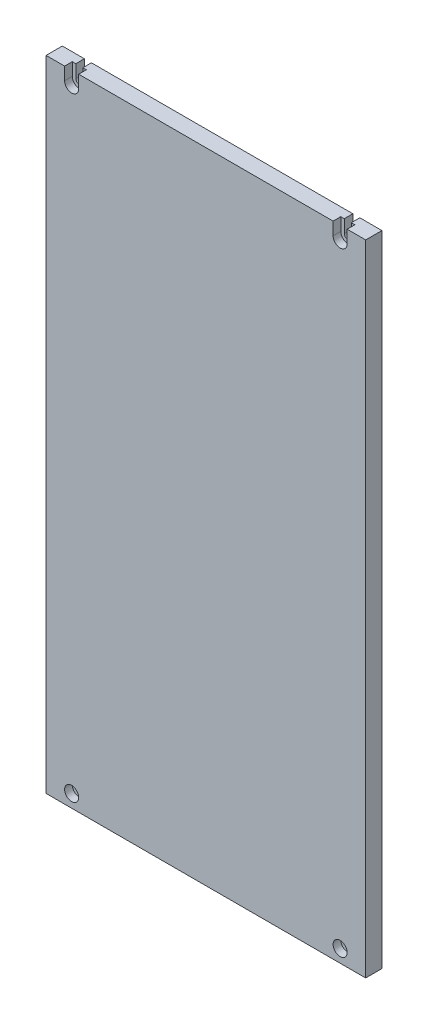
ISO-10303-21;
HEADER;
FILE_DESCRIPTION(('STEP AP214'),'2;1');
FILE_NAME('part.step','',(''),(''),'','','');
FILE_SCHEMA(('AUTOMOTIVE_DESIGN { 1 0 10303 214 1 1 1 1 }'));
ENDSEC;
DATA;
#1=APPLICATION_CONTEXT('core data for automotive mechanical design processes');
#2=APPLICATION_PROTOCOL_DEFINITION('international standard','automotive_design',2000,#1);
#3=PRODUCT_CONTEXT('',#1,'mechanical');
#4=PRODUCT('Part','Part','',(#3));
#5=PRODUCT_RELATED_PRODUCT_CATEGORY('part','',(#4));
#6=PRODUCT_DEFINITION_FORMATION('','',#4);
#7=PRODUCT_DEFINITION_CONTEXT('part definition',#1,'design');
#8=PRODUCT_DEFINITION('design','',#6,#7);
#9=PRODUCT_DEFINITION_SHAPE('','',#8);
#10=(LENGTH_UNIT() NAMED_UNIT(*) SI_UNIT(.MILLI.,.METRE.));
#11=(NAMED_UNIT(*) PLANE_ANGLE_UNIT() SI_UNIT($,.RADIAN.));
#12=(NAMED_UNIT(*) SI_UNIT($,.STERADIAN.) SOLID_ANGLE_UNIT());
#13=UNCERTAINTY_MEASURE_WITH_UNIT(LENGTH_MEASURE(1.E-05),#10,'distance_accuracy_value','');
#14=(GEOMETRIC_REPRESENTATION_CONTEXT(3) GLOBAL_UNCERTAINTY_ASSIGNED_CONTEXT((#13)) GLOBAL_UNIT_ASSIGNED_CONTEXT((#10,
#11,#12)) REPRESENTATION_CONTEXT('',''));
#15=CARTESIAN_POINT('',(0.,0.,0.));
#16=DIRECTION('',(0.,0.,1.));
#17=DIRECTION('',(1.,0.,0.));
#18=AXIS2_PLACEMENT_3D('',#15,#16,#17);
#19=CARTESIAN_POINT('',(105.,240.,9.7));
#20=DIRECTION('',(0.,0.,1.));
#21=DIRECTION('',(1.,0.,0.));
#22=AXIS2_PLACEMENT_3D('',#19,#20,#21);
#23=CYLINDRICAL_SURFACE('',#22,5.5);
#24=CARTESIAN_POINT('',(105.,240.,6.7));
#25=DIRECTION('',(0.,0.,1.));
#26=DIRECTION('',(1.,0.,0.));
#27=AXIS2_PLACEMENT_3D('',#24,#25,#26);
#28=CIRCLE('',#27,5.5);
#29=CARTESIAN_POINT('',(99.5,240.,6.7));
#30=VERTEX_POINT('',#29);
#31=CARTESIAN_POINT('',(110.5,240.,6.7));
#32=VERTEX_POINT('',#31);
#33=EDGE_CURVE('E232',#30,#32,#28,.T.);
#34=ORIENTED_EDGE('',*,*,#33,.F.);
#35=DIRECTION('',(0.,0.,1.));
#36=VECTOR('',#35,1.);
#37=CARTESIAN_POINT('',(99.5,240.,12.7));
#38=LINE('',#37,#36);
#39=CARTESIAN_POINT('',(99.5,240.,12.7));
#40=VERTEX_POINT('',#39);
#41=EDGE_CURVE('E195',#30,#40,#38,.T.);
#42=ORIENTED_EDGE('',*,*,#41,.T.);
#43=CARTESIAN_POINT('',(105.,240.,12.7));
#44=DIRECTION('',(0.,0.,1.));
#45=DIRECTION('',(1.,0.,0.));
#46=AXIS2_PLACEMENT_3D('',#43,#44,#45);
#47=CIRCLE('',#46,5.5);
#48=CARTESIAN_POINT('',(110.5,240.,12.7));
#49=VERTEX_POINT('',#48);
#50=EDGE_CURVE('E124',#49,#40,#47,.F.);
#51=ORIENTED_EDGE('',*,*,#50,.F.);
#52=DIRECTION('',(0.,0.,1.));
#53=VECTOR('',#52,1.);
#54=CARTESIAN_POINT('',(110.5,240.,12.7));
#55=LINE('',#54,#53);
#56=EDGE_CURVE('E115',#49,#32,#55,.F.);
#57=ORIENTED_EDGE('',*,*,#56,.T.);
#58=EDGE_LOOP('',(#34,#42,#51,#57));
#59=FACE_BOUND('',#58,.T.);
#60=ADVANCED_FACE('F16',(#59),#23,.F.);
#61=CARTESIAN_POINT('',(-105.,240.,9.7));
#62=DIRECTION('',(0.,0.,1.));
#63=DIRECTION('',(1.,0.,0.));
#64=AXIS2_PLACEMENT_3D('',#61,#62,#63);
#65=CYLINDRICAL_SURFACE('',#64,5.5);
#66=CARTESIAN_POINT('',(-105.,240.,6.7));
#67=DIRECTION('',(0.,0.,1.));
#68=DIRECTION('',(1.,0.,0.));
#69=AXIS2_PLACEMENT_3D('',#66,#67,#68);
#70=CIRCLE('',#69,5.5);
#71=CARTESIAN_POINT('',(-110.5,240.,6.7));
#72=VERTEX_POINT('',#71);
#73=CARTESIAN_POINT('',(-99.5,240.,6.7));
#74=VERTEX_POINT('',#73);
#75=EDGE_CURVE('E111',#72,#74,#70,.T.);
#76=ORIENTED_EDGE('',*,*,#75,.F.);
#77=DIRECTION('',(0.,0.,1.));
#78=VECTOR('',#77,1.);
#79=CARTESIAN_POINT('',(-110.5,240.,12.7));
#80=LINE('',#79,#78);
#81=CARTESIAN_POINT('',(-110.5,240.,12.7));
#82=VERTEX_POINT('',#81);
#83=EDGE_CURVE('E109',#72,#82,#80,.T.);
#84=ORIENTED_EDGE('',*,*,#83,.T.);
#85=CARTESIAN_POINT('',(-105.,240.,12.7));
#86=DIRECTION('',(0.,0.,1.));
#87=DIRECTION('',(1.,0.,0.));
#88=AXIS2_PLACEMENT_3D('',#85,#86,#87);
#89=CIRCLE('',#88,5.5);
#90=CARTESIAN_POINT('',(-99.5,240.,12.7));
#91=VERTEX_POINT('',#90);
#92=EDGE_CURVE('E95',#91,#82,#89,.F.);
#93=ORIENTED_EDGE('',*,*,#92,.F.);
#94=DIRECTION('',(0.,0.,1.));
#95=VECTOR('',#94,1.);
#96=CARTESIAN_POINT('',(-99.5,240.,12.7));
#97=LINE('',#96,#95);
#98=EDGE_CURVE('E89',#91,#74,#97,.F.);
#99=ORIENTED_EDGE('',*,*,#98,.T.);
#100=EDGE_LOOP('',(#76,#84,#93,#99));
#101=FACE_BOUND('',#100,.T.);
#102=ADVANCED_FACE('F110',(#101),#65,.F.);
#103=CARTESIAN_POINT('',(-105.,-240.,9.7));
#104=DIRECTION('',(0.,0.,1.));
#105=DIRECTION('',(1.,0.,0.));
#106=AXIS2_PLACEMENT_3D('',#103,#104,#105);
#107=CYLINDRICAL_SURFACE('',#106,5.5);
#108=CARTESIAN_POINT('',(-105.,-240.,6.7));
#109=DIRECTION('',(0.,0.,1.));
#110=DIRECTION('',(1.,0.,0.));
#111=AXIS2_PLACEMENT_3D('',#108,#109,#110);
#112=CIRCLE('',#111,5.5);
#113=CARTESIAN_POINT('',(-99.5,-240.,6.7));
#114=VERTEX_POINT('',#113);
#115=EDGE_CURVE('E226',#114,#114,#112,.T.);
#116=ORIENTED_EDGE('',*,*,#115,.F.);
#117=EDGE_LOOP('',(#116));
#118=FACE_BOUND('',#117,.T.);
#119=CARTESIAN_POINT('',(-105.,-240.,12.7));
#120=DIRECTION('',(0.,0.,1.));
#121=DIRECTION('',(1.,0.,0.));
#122=AXIS2_PLACEMENT_3D('',#119,#120,#121);
#123=CIRCLE('',#122,5.5);
#124=CARTESIAN_POINT('',(-99.5,-240.,12.7));
#125=VERTEX_POINT('',#124);
#126=EDGE_CURVE('E132',#125,#125,#123,.F.);
#127=ORIENTED_EDGE('',*,*,#126,.F.);
#128=EDGE_LOOP('',(#127));
#129=FACE_BOUND('',#128,.T.);
#130=ADVANCED_FACE('F244',(#118,#129),#107,.F.);
#131=CARTESIAN_POINT('',(105.,-240.,9.7));
#132=DIRECTION('',(0.,0.,1.));
#133=DIRECTION('',(1.,0.,0.));
#134=AXIS2_PLACEMENT_3D('',#131,#132,#133);
#135=CYLINDRICAL_SURFACE('',#134,5.5);
#136=CARTESIAN_POINT('',(105.,-240.,6.7));
#137=DIRECTION('',(0.,0.,1.));
#138=DIRECTION('',(1.,0.,0.));
#139=AXIS2_PLACEMENT_3D('',#136,#137,#138);
#140=CIRCLE('',#139,5.5);
#141=CARTESIAN_POINT('',(110.5,-240.,6.7));
#142=VERTEX_POINT('',#141);
#143=EDGE_CURVE('E186',#142,#142,#140,.T.);
#144=ORIENTED_EDGE('',*,*,#143,.F.);
#145=EDGE_LOOP('',(#144));
#146=FACE_BOUND('',#145,.T.);
#147=CARTESIAN_POINT('',(105.,-240.,12.7));
#148=DIRECTION('',(0.,0.,1.));
#149=DIRECTION('',(1.,0.,0.));
#150=AXIS2_PLACEMENT_3D('',#147,#148,#149);
#151=CIRCLE('',#150,5.5);
#152=CARTESIAN_POINT('',(110.5,-240.,12.7));
#153=VERTEX_POINT('',#152);
#154=EDGE_CURVE('E19',#153,#153,#151,.F.);
#155=ORIENTED_EDGE('',*,*,#154,.F.);
#156=EDGE_LOOP('',(#155));
#157=FACE_BOUND('',#156,.T.);
#158=ADVANCED_FACE('F242',(#146,#157),#135,.F.);
#159=CARTESIAN_POINT('',(-110.5,240.,12.7));
#160=DIRECTION('',(-1.,0.,0.));
#161=DIRECTION('',(0.,0.,1.));
#162=AXIS2_PLACEMENT_3D('',#159,#160,#161);
#163=PLANE('',#162);
#164=ORIENTED_EDGE('',*,*,#83,.F.);
#165=DIRECTION('',(0.,1.,0.));
#166=VECTOR('',#165,1.);
#167=CARTESIAN_POINT('',(-110.5,240.,6.7));
#168=LINE('',#167,#166);
#169=CARTESIAN_POINT('',(-110.5,250.,6.7));
#170=VERTEX_POINT('',#169);
#171=EDGE_CURVE('E231',#170,#72,#168,.F.);
#172=ORIENTED_EDGE('',*,*,#171,.F.);
#173=DIRECTION('',(0.,0.,1.));
#174=VECTOR('',#173,1.);
#175=CARTESIAN_POINT('',(-110.5,250.,0.));
#176=LINE('',#175,#174);
#177=CARTESIAN_POINT('',(-110.5,250.,12.7));
#178=VERTEX_POINT('',#177);
#179=EDGE_CURVE('E120',#178,#170,#176,.F.);
#180=ORIENTED_EDGE('',*,*,#179,.F.);
#181=DIRECTION('',(0.,1.,0.));
#182=VECTOR('',#181,1.);
#183=CARTESIAN_POINT('',(-110.5,0.,12.7));
#184=LINE('',#183,#182);
#185=EDGE_CURVE('E102',#82,#178,#184,.T.);
#186=ORIENTED_EDGE('',*,*,#185,.F.);
#187=EDGE_LOOP('',(#164,#172,#180,#186));
#188=FACE_BOUND('',#187,.T.);
#189=ADVANCED_FACE('F118',(#188),#163,.F.);
#190=CARTESIAN_POINT('',(110.5,250.,12.7));
#191=DIRECTION('',(1.,0.,0.));
#192=DIRECTION('',(0.,1.,0.));
#193=AXIS2_PLACEMENT_3D('',#190,#191,#192);
#194=PLANE('',#193);
#195=DIRECTION('',(0.,0.,1.));
#196=VECTOR('',#195,1.);
#197=CARTESIAN_POINT('',(110.5,250.,0.));
#198=LINE('',#197,#196);
#199=CARTESIAN_POINT('',(110.5,250.,6.7));
#200=VERTEX_POINT('',#199);
#201=CARTESIAN_POINT('',(110.5,250.,12.7));
#202=VERTEX_POINT('',#201);
#203=EDGE_CURVE('E152',#200,#202,#198,.T.);
#204=ORIENTED_EDGE('',*,*,#203,.F.);
#205=DIRECTION('',(0.,1.,0.));
#206=VECTOR('',#205,1.);
#207=CARTESIAN_POINT('',(110.5,240.,6.7));
#208=LINE('',#207,#206);
#209=EDGE_CURVE('E234',#32,#200,#208,.T.);
#210=ORIENTED_EDGE('',*,*,#209,.F.);
#211=ORIENTED_EDGE('',*,*,#56,.F.);
#212=DIRECTION('',(0.,1.,0.));
#213=VECTOR('',#212,1.);
#214=CARTESIAN_POINT('',(110.5,0.,12.7));
#215=LINE('',#214,#213);
#216=EDGE_CURVE('E121',#202,#49,#215,.F.);
#217=ORIENTED_EDGE('',*,*,#216,.F.);
#218=EDGE_LOOP('',(#204,#210,#211,#217));
#219=FACE_BOUND('',#218,.T.);
#220=ADVANCED_FACE('F252',(#219),#194,.F.);
#221=CARTESIAN_POINT('',(-99.5,250.,12.7));
#222=DIRECTION('',(1.,0.,0.));
#223=DIRECTION('',(0.,1.,0.));
#224=AXIS2_PLACEMENT_3D('',#221,#222,#223);
#225=PLANE('',#224);
#226=DIRECTION('',(0.,0.,1.));
#227=VECTOR('',#226,1.);
#228=CARTESIAN_POINT('',(-99.5,250.,0.));
#229=LINE('',#228,#227);
#230=CARTESIAN_POINT('',(-99.5,250.,6.7));
#231=VERTEX_POINT('',#230);
#232=CARTESIAN_POINT('',(-99.5,250.,12.7));
#233=VERTEX_POINT('',#232);
#234=EDGE_CURVE('E135',#231,#233,#229,.T.);
#235=ORIENTED_EDGE('',*,*,#234,.F.);
#236=DIRECTION('',(0.,1.,0.));
#237=VECTOR('',#236,1.);
#238=CARTESIAN_POINT('',(-99.5,240.,6.7));
#239=LINE('',#238,#237);
#240=EDGE_CURVE('E229',#74,#231,#239,.T.);
#241=ORIENTED_EDGE('',*,*,#240,.F.);
#242=ORIENTED_EDGE('',*,*,#98,.F.);
#243=DIRECTION('',(0.,1.,0.));
#244=VECTOR('',#243,1.);
#245=CARTESIAN_POINT('',(-99.5,0.,12.7));
#246=LINE('',#245,#244);
#247=EDGE_CURVE('E105',#233,#91,#246,.F.);
#248=ORIENTED_EDGE('',*,*,#247,.F.);
#249=EDGE_LOOP('',(#235,#241,#242,#248));
#250=FACE_BOUND('',#249,.T.);
#251=ADVANCED_FACE('F343',(#250),#225,.F.);
#252=CARTESIAN_POINT('',(0.,0.,12.7));
#253=DIRECTION('',(0.,0.,1.));
#254=DIRECTION('',(1.,0.,0.));
#255=AXIS2_PLACEMENT_3D('',#252,#253,#254);
#256=PLANE('',#255);
#257=DIRECTION('',(0.,-1.,0.));
#258=VECTOR('',#257,1.);
#259=CARTESIAN_POINT('',(99.5,240.,12.7));
#260=LINE('',#259,#258);
#261=CARTESIAN_POINT('',(99.5,250.,12.7));
#262=VERTEX_POINT('',#261);
#263=EDGE_CURVE('E197',#40,#262,#260,.F.);
#264=ORIENTED_EDGE('',*,*,#263,.T.);
#265=DIRECTION('',(1.,0.,0.));
#266=VECTOR('',#265,1.);
#267=CARTESIAN_POINT('',(125.,250.,12.7));
#268=LINE('',#267,#266);
#269=EDGE_CURVE('E138',#233,#262,#268,.T.);
#270=ORIENTED_EDGE('',*,*,#269,.F.);
#271=ORIENTED_EDGE('',*,*,#247,.T.);
#272=ORIENTED_EDGE('',*,*,#92,.T.);
#273=ORIENTED_EDGE('',*,*,#185,.T.);
#274=DIRECTION('',(1.,0.,0.));
#275=VECTOR('',#274,1.);
#276=CARTESIAN_POINT('',(125.,250.,12.7));
#277=LINE('',#276,#275);
#278=CARTESIAN_POINT('',(-125.,250.,12.7));
#279=VERTEX_POINT('',#278);
#280=EDGE_CURVE('E184',#279,#178,#277,.T.);
#281=ORIENTED_EDGE('',*,*,#280,.F.);
#282=DIRECTION('',(0.,-1.,0.));
#283=VECTOR('',#282,1.);
#284=CARTESIAN_POINT('',(-125.,250.,12.7));
#285=LINE('',#284,#283);
#286=CARTESIAN_POINT('',(-125.,-250.,12.7));
#287=VERTEX_POINT('',#286);
#288=EDGE_CURVE('E178',#287,#279,#285,.F.);
#289=ORIENTED_EDGE('',*,*,#288,.F.);
#290=DIRECTION('',(1.,0.,0.));
#291=VECTOR('',#290,1.);
#292=CARTESIAN_POINT('',(-125.,-250.,12.7));
#293=LINE('',#292,#291);
#294=CARTESIAN_POINT('',(125.,-250.,12.7));
#295=VERTEX_POINT('',#294);
#296=EDGE_CURVE('E172',#295,#287,#293,.F.);
#297=ORIENTED_EDGE('',*,*,#296,.F.);
#298=DIRECTION('',(0.,1.,0.));
#299=VECTOR('',#298,1.);
#300=CARTESIAN_POINT('',(125.,-250.,12.7));
#301=LINE('',#300,#299);
#302=CARTESIAN_POINT('',(125.,250.,12.7));
#303=VERTEX_POINT('',#302);
#304=EDGE_CURVE('E156',#303,#295,#301,.F.);
#305=ORIENTED_EDGE('',*,*,#304,.F.);
#306=DIRECTION('',(1.,0.,0.));
#307=VECTOR('',#306,1.);
#308=CARTESIAN_POINT('',(125.,250.,12.7));
#309=LINE('',#308,#307);
#310=EDGE_CURVE('E162',#202,#303,#309,.T.);
#311=ORIENTED_EDGE('',*,*,#310,.F.);
#312=ORIENTED_EDGE('',*,*,#216,.T.);
#313=ORIENTED_EDGE('',*,*,#50,.T.);
#314=EDGE_LOOP('',(#264,#270,#271,#272,#273,#281,#289,#297,#305,#311,#312,#313));
#315=FACE_BOUND('',#314,.T.);
#316=ORIENTED_EDGE('',*,*,#126,.T.);
#317=EDGE_LOOP('',(#316));
#318=FACE_BOUND('',#317,.T.);
#319=ORIENTED_EDGE('',*,*,#154,.T.);
#320=EDGE_LOOP('',(#319));
#321=FACE_BOUND('',#320,.T.);
#322=ADVANCED_FACE('F98',(#315,#318,#321),#256,.T.);
#323=CARTESIAN_POINT('',(99.5,240.,12.7));
#324=DIRECTION('',(-1.,0.,0.));
#325=DIRECTION('',(0.,-1.,0.));
#326=AXIS2_PLACEMENT_3D('',#323,#324,#325);
#327=PLANE('',#326);
#328=ORIENTED_EDGE('',*,*,#41,.F.);
#329=DIRECTION('',(0.,1.,0.));
#330=VECTOR('',#329,1.);
#331=CARTESIAN_POINT('',(99.5,240.,6.7));
#332=LINE('',#331,#330);
#333=CARTESIAN_POINT('',(99.5,250.,6.7));
#334=VERTEX_POINT('',#333);
#335=EDGE_CURVE('E235',#334,#30,#332,.F.);
#336=ORIENTED_EDGE('',*,*,#335,.F.);
#337=DIRECTION('',(0.,0.,1.));
#338=VECTOR('',#337,1.);
#339=CARTESIAN_POINT('',(99.5,250.,0.));
#340=LINE('',#339,#338);
#341=EDGE_CURVE('E387',#262,#334,#340,.F.);
#342=ORIENTED_EDGE('',*,*,#341,.F.);
#343=ORIENTED_EDGE('',*,*,#263,.F.);
#344=EDGE_LOOP('',(#328,#336,#342,#343));
#345=FACE_BOUND('',#344,.T.);
#346=ADVANCED_FACE('F336',(#345),#327,.F.);
#347=CARTESIAN_POINT('',(105.,240.,6.7));
#348=DIRECTION('',(0.,0.,1.));
#349=DIRECTION('',(1.,0.,0.));
#350=AXIS2_PLACEMENT_3D('',#347,#348,#349);
#351=PLANE('',#350);
#352=ORIENTED_EDGE('',*,*,#209,.T.);
#353=DIRECTION('',(1.,0.,0.));
#354=VECTOR('',#353,1.);
#355=CARTESIAN_POINT('',(125.,250.,6.7));
#356=LINE('',#355,#354);
#357=CARTESIAN_POINT('',(107.75,250.,6.7));
#358=VERTEX_POINT('',#357);
#359=EDGE_CURVE('E149',#358,#200,#356,.T.);
#360=ORIENTED_EDGE('',*,*,#359,.F.);
#361=DIRECTION('',(0.,1.,0.));
#362=VECTOR('',#361,1.);
#363=CARTESIAN_POINT('',(107.75,250.,6.7));
#364=LINE('',#363,#362);
#365=CARTESIAN_POINT('',(107.75,240.,6.70000000000003));
#366=VERTEX_POINT('',#365);
#367=EDGE_CURVE('E142',#358,#366,#364,.F.);
#368=ORIENTED_EDGE('',*,*,#367,.T.);
#369=CARTESIAN_POINT('',(105.,240.,6.70000000000004));
#370=DIRECTION('',(0.,0.,1.));
#371=DIRECTION('',(1.,0.,0.));
#372=AXIS2_PLACEMENT_3D('',#369,#370,#371);
#373=CIRCLE('',#372,2.75);
#374=CARTESIAN_POINT('',(102.25,240.,6.70000000000002));
#375=VERTEX_POINT('',#374);
#376=EDGE_CURVE('E145',#366,#375,#373,.F.);
#377=ORIENTED_EDGE('',*,*,#376,.T.);
#378=DIRECTION('',(0.,1.,0.));
#379=VECTOR('',#378,1.);
#380=CARTESIAN_POINT('',(102.25,240.,6.69999999999999));
#381=LINE('',#380,#379);
#382=CARTESIAN_POINT('',(102.25,250.,6.7));
#383=VERTEX_POINT('',#382);
#384=EDGE_CURVE('E475',#375,#383,#381,.T.);
#385=ORIENTED_EDGE('',*,*,#384,.T.);
#386=DIRECTION('',(1.,0.,0.));
#387=VECTOR('',#386,1.);
#388=CARTESIAN_POINT('',(125.,250.,6.7));
#389=LINE('',#388,#387);
#390=EDGE_CURVE('E392',#334,#383,#389,.T.);
#391=ORIENTED_EDGE('',*,*,#390,.F.);
#392=ORIENTED_EDGE('',*,*,#335,.T.);
#393=ORIENTED_EDGE('',*,*,#33,.T.);
#394=EDGE_LOOP('',(#352,#360,#368,#377,#385,#391,#392,#393));
#395=FACE_BOUND('',#394,.T.);
#396=ADVANCED_FACE('F332',(#395),#351,.T.);
#397=CARTESIAN_POINT('',(-105.,240.,6.7));
#398=DIRECTION('',(0.,0.,1.));
#399=DIRECTION('',(1.,0.,0.));
#400=AXIS2_PLACEMENT_3D('',#397,#398,#399);
#401=PLANE('',#400);
#402=DIRECTION('',(0.,1.,0.));
#403=VECTOR('',#402,1.);
#404=CARTESIAN_POINT('',(-102.25,250.,6.7));
#405=LINE('',#404,#403);
#406=CARTESIAN_POINT('',(-102.25,250.,6.7));
#407=VERTEX_POINT('',#406);
#408=CARTESIAN_POINT('',(-102.25,240.,6.70000000000003));
#409=VERTEX_POINT('',#408);
#410=EDGE_CURVE('E466',#407,#409,#405,.F.);
#411=ORIENTED_EDGE('',*,*,#410,.T.);
#412=CARTESIAN_POINT('',(-105.,240.,6.70000000000004));
#413=DIRECTION('',(0.,0.,1.));
#414=DIRECTION('',(1.,0.,0.));
#415=AXIS2_PLACEMENT_3D('',#412,#413,#414);
#416=CIRCLE('',#415,2.75);
#417=CARTESIAN_POINT('',(-107.75,240.,6.70000000000002));
#418=VERTEX_POINT('',#417);
#419=EDGE_CURVE('E219',#409,#418,#416,.F.);
#420=ORIENTED_EDGE('',*,*,#419,.T.);
#421=DIRECTION('',(0.,-1.,0.));
#422=VECTOR('',#421,1.);
#423=CARTESIAN_POINT('',(-107.75,240.,6.69999999999999));
#424=LINE('',#423,#422);
#425=CARTESIAN_POINT('',(-107.75,250.,6.69999999999999));
#426=VERTEX_POINT('',#425);
#427=EDGE_CURVE('E456',#418,#426,#424,.F.);
#428=ORIENTED_EDGE('',*,*,#427,.T.);
#429=DIRECTION('',(1.,0.,0.));
#430=VECTOR('',#429,1.);
#431=CARTESIAN_POINT('',(125.,250.,6.7));
#432=LINE('',#431,#430);
#433=EDGE_CURVE('E181',#170,#426,#432,.T.);
#434=ORIENTED_EDGE('',*,*,#433,.F.);
#435=ORIENTED_EDGE('',*,*,#171,.T.);
#436=ORIENTED_EDGE('',*,*,#75,.T.);
#437=ORIENTED_EDGE('',*,*,#240,.T.);
#438=DIRECTION('',(1.,0.,0.));
#439=VECTOR('',#438,1.);
#440=CARTESIAN_POINT('',(125.,250.,6.7));
#441=LINE('',#440,#439);
#442=EDGE_CURVE('E139',#407,#231,#441,.T.);
#443=ORIENTED_EDGE('',*,*,#442,.F.);
#444=EDGE_LOOP('',(#411,#420,#428,#434,#435,#436,#437,#443));
#445=FACE_BOUND('',#444,.T.);
#446=ADVANCED_FACE('F328',(#445),#401,.T.);
#447=CARTESIAN_POINT('',(-105.,-240.,6.7));
#448=DIRECTION('',(0.,0.,1.));
#449=DIRECTION('',(1.,0.,0.));
#450=AXIS2_PLACEMENT_3D('',#447,#448,#449);
#451=PLANE('',#450);
#452=CARTESIAN_POINT('',(-105.,-240.,6.70000000000004));
#453=DIRECTION('',(0.,0.,1.));
#454=DIRECTION('',(1.,0.,0.));
#455=AXIS2_PLACEMENT_3D('',#452,#453,#454);
#456=CIRCLE('',#455,2.75);
#457=CARTESIAN_POINT('',(-102.25,-240.,6.70000000000004));
#458=VERTEX_POINT('',#457);
#459=EDGE_CURVE('E215',#458,#458,#456,.F.);
#460=ORIENTED_EDGE('',*,*,#459,.T.);
#461=EDGE_LOOP('',(#460));
#462=FACE_BOUND('',#461,.T.);
#463=ORIENTED_EDGE('',*,*,#115,.T.);
#464=EDGE_LOOP('',(#463));
#465=FACE_BOUND('',#464,.T.);
#466=ADVANCED_FACE('F324',(#462,#465),#451,.T.);
#467=CARTESIAN_POINT('',(105.,-240.,6.7));
#468=DIRECTION('',(0.,0.,1.));
#469=DIRECTION('',(1.,0.,0.));
#470=AXIS2_PLACEMENT_3D('',#467,#468,#469);
#471=PLANE('',#470);
#472=CARTESIAN_POINT('',(105.,-240.,6.70000000000004));
#473=DIRECTION('',(0.,0.,1.));
#474=DIRECTION('',(1.,0.,0.));
#475=AXIS2_PLACEMENT_3D('',#472,#473,#474);
#476=CIRCLE('',#475,2.75);
#477=CARTESIAN_POINT('',(107.75,-240.,6.70000000000004));
#478=VERTEX_POINT('',#477);
#479=EDGE_CURVE('E211',#478,#478,#476,.F.);
#480=ORIENTED_EDGE('',*,*,#479,.T.);
#481=EDGE_LOOP('',(#480));
#482=FACE_BOUND('',#481,.T.);
#483=ORIENTED_EDGE('',*,*,#143,.T.);
#484=EDGE_LOOP('',(#483));
#485=FACE_BOUND('',#484,.T.);
#486=ADVANCED_FACE('F320',(#482,#485),#471,.T.);
#487=CARTESIAN_POINT('',(125.,250.,0.));
#488=DIRECTION('',(0.,1.,0.));
#489=DIRECTION('',(0.,0.,1.));
#490=AXIS2_PLACEMENT_3D('',#487,#488,#489);
#491=PLANE('',#490);
#492=ORIENTED_EDGE('',*,*,#179,.T.);
#493=ORIENTED_EDGE('',*,*,#433,.T.);
#494=DIRECTION('',(0.,0.,1.));
#495=VECTOR('',#494,1.);
#496=CARTESIAN_POINT('',(-107.75,250.,6.7));
#497=LINE('',#496,#495);
#498=CARTESIAN_POINT('',(-107.75,250.,0.));
#499=VERTEX_POINT('',#498);
#500=EDGE_CURVE('E218',#426,#499,#497,.F.);
#501=ORIENTED_EDGE('',*,*,#500,.T.);
#502=DIRECTION('',(1.,0.,0.));
#503=VECTOR('',#502,1.);
#504=CARTESIAN_POINT('',(0.,250.,0.));
#505=LINE('',#504,#503);
#506=CARTESIAN_POINT('',(-125.,250.,0.));
#507=VERTEX_POINT('',#506);
#508=EDGE_CURVE('E214',#499,#507,#505,.F.);
#509=ORIENTED_EDGE('',*,*,#508,.T.);
#510=DIRECTION('',(0.,0.,1.));
#511=VECTOR('',#510,1.);
#512=CARTESIAN_POINT('',(-125.,250.,0.));
#513=LINE('',#512,#511);
#514=EDGE_CURVE('E175',#279,#507,#513,.F.);
#515=ORIENTED_EDGE('',*,*,#514,.F.);
#516=ORIENTED_EDGE('',*,*,#280,.T.);
#517=EDGE_LOOP('',(#492,#493,#501,#509,#515,#516));
#518=FACE_BOUND('',#517,.T.);
#519=ADVANCED_FACE('F316',(#518),#491,.T.);
#520=CARTESIAN_POINT('',(-125.,250.,0.));
#521=DIRECTION('',(-1.,0.,0.));
#522=DIRECTION('',(0.,-1.,0.));
#523=AXIS2_PLACEMENT_3D('',#520,#521,#522);
#524=PLANE('',#523);
#525=ORIENTED_EDGE('',*,*,#288,.T.);
#526=ORIENTED_EDGE('',*,*,#514,.T.);
#527=DIRECTION('',(0.,1.,0.));
#528=VECTOR('',#527,1.);
#529=CARTESIAN_POINT('',(-125.,0.,0.));
#530=LINE('',#529,#528);
#531=CARTESIAN_POINT('',(-125.,-250.,0.));
#532=VERTEX_POINT('',#531);
#533=EDGE_CURVE('E461',#507,#532,#530,.F.);
#534=ORIENTED_EDGE('',*,*,#533,.T.);
#535=DIRECTION('',(0.,0.,1.));
#536=VECTOR('',#535,1.);
#537=CARTESIAN_POINT('',(-125.,-250.,0.));
#538=LINE('',#537,#536);
#539=EDGE_CURVE('E159',#287,#532,#538,.F.);
#540=ORIENTED_EDGE('',*,*,#539,.F.);
#541=EDGE_LOOP('',(#525,#526,#534,#540));
#542=FACE_BOUND('',#541,.T.);
#543=ADVANCED_FACE('F312',(#542),#524,.T.);
#544=CARTESIAN_POINT('',(-125.,-250.,0.));
#545=DIRECTION('',(0.,-1.,0.));
#546=DIRECTION('',(1.,0.,0.));
#547=AXIS2_PLACEMENT_3D('',#544,#545,#546);
#548=PLANE('',#547);
#549=ORIENTED_EDGE('',*,*,#296,.T.);
#550=ORIENTED_EDGE('',*,*,#539,.T.);
#551=DIRECTION('',(1.,0.,0.));
#552=VECTOR('',#551,1.);
#553=CARTESIAN_POINT('',(0.,-250.,0.));
#554=LINE('',#553,#552);
#555=CARTESIAN_POINT('',(125.,-250.,0.));
#556=VERTEX_POINT('',#555);
#557=EDGE_CURVE('E491',#532,#556,#554,.T.);
#558=ORIENTED_EDGE('',*,*,#557,.T.);
#559=DIRECTION('',(0.,0.,1.));
#560=VECTOR('',#559,1.);
#561=CARTESIAN_POINT('',(125.,-250.,0.));
#562=LINE('',#561,#560);
#563=EDGE_CURVE('E153',#295,#556,#562,.F.);
#564=ORIENTED_EDGE('',*,*,#563,.F.);
#565=EDGE_LOOP('',(#549,#550,#558,#564));
#566=FACE_BOUND('',#565,.T.);
#567=ADVANCED_FACE('F308',(#566),#548,.T.);
#568=CARTESIAN_POINT('',(125.,-250.,0.));
#569=DIRECTION('',(1.,0.,0.));
#570=DIRECTION('',(0.,1.,0.));
#571=AXIS2_PLACEMENT_3D('',#568,#569,#570);
#572=PLANE('',#571);
#573=ORIENTED_EDGE('',*,*,#304,.T.);
#574=ORIENTED_EDGE('',*,*,#563,.T.);
#575=DIRECTION('',(0.,1.,0.));
#576=VECTOR('',#575,1.);
#577=CARTESIAN_POINT('',(125.,0.,0.));
#578=LINE('',#577,#576);
#579=CARTESIAN_POINT('',(125.,250.,0.));
#580=VERTEX_POINT('',#579);
#581=EDGE_CURVE('E483',#556,#580,#578,.T.);
#582=ORIENTED_EDGE('',*,*,#581,.T.);
#583=DIRECTION('',(0.,0.,1.));
#584=VECTOR('',#583,1.);
#585=CARTESIAN_POINT('',(125.,250.,0.));
#586=LINE('',#585,#584);
#587=EDGE_CURVE('E165',#303,#580,#586,.F.);
#588=ORIENTED_EDGE('',*,*,#587,.F.);
#589=EDGE_LOOP('',(#573,#574,#582,#588));
#590=FACE_BOUND('',#589,.T.);
#591=ADVANCED_FACE('F304',(#590),#572,.T.);
#592=CARTESIAN_POINT('',(125.,250.,0.));
#593=DIRECTION('',(0.,1.,0.));
#594=DIRECTION('',(0.,0.,1.));
#595=AXIS2_PLACEMENT_3D('',#592,#593,#594);
#596=PLANE('',#595);
#597=ORIENTED_EDGE('',*,*,#587,.T.);
#598=DIRECTION('',(1.,0.,0.));
#599=VECTOR('',#598,1.);
#600=CARTESIAN_POINT('',(0.,250.,0.));
#601=LINE('',#600,#599);
#602=CARTESIAN_POINT('',(107.75,250.,0.));
#603=VERTEX_POINT('',#602);
#604=EDGE_CURVE('E452',#580,#603,#601,.F.);
#605=ORIENTED_EDGE('',*,*,#604,.T.);
#606=DIRECTION('',(0.,0.,-1.));
#607=VECTOR('',#606,1.);
#608=CARTESIAN_POINT('',(107.75,250.,6.7));
#609=LINE('',#608,#607);
#610=EDGE_CURVE('E146',#603,#358,#609,.F.);
#611=ORIENTED_EDGE('',*,*,#610,.T.);
#612=ORIENTED_EDGE('',*,*,#359,.T.);
#613=ORIENTED_EDGE('',*,*,#203,.T.);
#614=ORIENTED_EDGE('',*,*,#310,.T.);
#615=EDGE_LOOP('',(#597,#605,#611,#612,#613,#614));
#616=FACE_BOUND('',#615,.T.);
#617=ADVANCED_FACE('F300',(#616),#596,.T.);
#618=CARTESIAN_POINT('',(107.75,250.,6.7));
#619=DIRECTION('',(1.,0.,0.));
#620=DIRECTION('',(0.,0.,-1.));
#621=AXIS2_PLACEMENT_3D('',#618,#619,#620);
#622=PLANE('',#621);
#623=DIRECTION('',(0.,0.,1.));
#624=VECTOR('',#623,1.);
#625=CARTESIAN_POINT('',(107.75,240.,-546.461237926951));
#626=LINE('',#625,#624);
#627=CARTESIAN_POINT('',(107.75,240.,0.));
#628=VERTEX_POINT('',#627);
#629=EDGE_CURVE('E223',#628,#366,#626,.T.);
#630=ORIENTED_EDGE('',*,*,#629,.T.);
#631=ORIENTED_EDGE('',*,*,#367,.F.);
#632=ORIENTED_EDGE('',*,*,#610,.F.);
#633=DIRECTION('',(0.,1.,0.));
#634=VECTOR('',#633,1.);
#635=CARTESIAN_POINT('',(107.75,0.,0.));
#636=LINE('',#635,#634);
#637=EDGE_CURVE('E210',#603,#628,#636,.F.);
#638=ORIENTED_EDGE('',*,*,#637,.T.);
#639=EDGE_LOOP('',(#630,#631,#632,#638));
#640=FACE_BOUND('',#639,.T.);
#641=ADVANCED_FACE('F296',(#640),#622,.F.);
#642=CARTESIAN_POINT('',(105.,240.,-546.461237926951));
#643=DIRECTION('',(0.,0.,1.));
#644=DIRECTION('',(1.,0.,0.));
#645=AXIS2_PLACEMENT_3D('',#642,#643,#644);
#646=CYLINDRICAL_SURFACE('',#645,2.75);
#647=CARTESIAN_POINT('',(105.,240.,0.));
#648=DIRECTION('',(0.,0.,1.));
#649=DIRECTION('',(1.,0.,0.));
#650=AXIS2_PLACEMENT_3D('',#647,#648,#649);
#651=CIRCLE('',#650,2.75);
#652=CARTESIAN_POINT('',(102.25,240.,0.));
#653=VERTEX_POINT('',#652);
#654=EDGE_CURVE('E206',#628,#653,#651,.F.);
#655=ORIENTED_EDGE('',*,*,#654,.T.);
#656=DIRECTION('',(0.,0.,1.));
#657=VECTOR('',#656,1.);
#658=CARTESIAN_POINT('',(102.25,240.,6.7));
#659=LINE('',#658,#657);
#660=EDGE_CURVE('E442',#653,#375,#659,.T.);
#661=ORIENTED_EDGE('',*,*,#660,.T.);
#662=ORIENTED_EDGE('',*,*,#376,.F.);
#663=ORIENTED_EDGE('',*,*,#629,.F.);
#664=EDGE_LOOP('',(#655,#661,#662,#663));
#665=FACE_BOUND('',#664,.T.);
#666=ADVANCED_FACE('F292',(#665),#646,.F.);
#667=CARTESIAN_POINT('',(102.25,240.,6.7));
#668=DIRECTION('',(-1.,0.,0.));
#669=DIRECTION('',(0.,0.,1.));
#670=AXIS2_PLACEMENT_3D('',#667,#668,#669);
#671=PLANE('',#670);
#672=DIRECTION('',(0.,0.,1.));
#673=VECTOR('',#672,1.);
#674=CARTESIAN_POINT('',(102.25,250.,0.));
#675=LINE('',#674,#673);
#676=CARTESIAN_POINT('',(102.25,250.,0.));
#677=VERTEX_POINT('',#676);
#678=EDGE_CURVE('E427',#383,#677,#675,.F.);
#679=ORIENTED_EDGE('',*,*,#678,.F.);
#680=ORIENTED_EDGE('',*,*,#384,.F.);
#681=ORIENTED_EDGE('',*,*,#660,.F.);
#682=DIRECTION('',(0.,1.,0.));
#683=VECTOR('',#682,1.);
#684=CARTESIAN_POINT('',(102.25,0.,0.));
#685=LINE('',#684,#683);
#686=EDGE_CURVE('E209',#653,#677,#685,.T.);
#687=ORIENTED_EDGE('',*,*,#686,.T.);
#688=EDGE_LOOP('',(#679,#680,#681,#687));
#689=FACE_BOUND('',#688,.T.);
#690=ADVANCED_FACE('F288',(#689),#671,.F.);
#691=CARTESIAN_POINT('',(125.,250.,0.));
#692=DIRECTION('',(0.,1.,0.));
#693=DIRECTION('',(0.,0.,1.));
#694=AXIS2_PLACEMENT_3D('',#691,#692,#693);
#695=PLANE('',#694);
#696=ORIENTED_EDGE('',*,*,#678,.T.);
#697=DIRECTION('',(1.,0.,0.));
#698=VECTOR('',#697,1.);
#699=CARTESIAN_POINT('',(0.,250.,0.));
#700=LINE('',#699,#698);
#701=CARTESIAN_POINT('',(-102.25,250.,0.));
#702=VERTEX_POINT('',#701);
#703=EDGE_CURVE('E430',#677,#702,#700,.F.);
#704=ORIENTED_EDGE('',*,*,#703,.T.);
#705=DIRECTION('',(0.,0.,1.));
#706=VECTOR('',#705,1.);
#707=CARTESIAN_POINT('',(-102.25,250.,6.7));
#708=LINE('',#707,#706);
#709=EDGE_CURVE('E433',#702,#407,#708,.T.);
#710=ORIENTED_EDGE('',*,*,#709,.T.);
#711=ORIENTED_EDGE('',*,*,#442,.T.);
#712=ORIENTED_EDGE('',*,*,#234,.T.);
#713=ORIENTED_EDGE('',*,*,#269,.T.);
#714=ORIENTED_EDGE('',*,*,#341,.T.);
#715=ORIENTED_EDGE('',*,*,#390,.T.);
#716=EDGE_LOOP('',(#696,#704,#710,#711,#712,#713,#714,#715));
#717=FACE_BOUND('',#716,.T.);
#718=ADVANCED_FACE('F284',(#717),#695,.T.);
#719=CARTESIAN_POINT('',(-102.25,250.,6.7));
#720=DIRECTION('',(1.,0.,0.));
#721=DIRECTION('',(0.,1.,0.));
#722=AXIS2_PLACEMENT_3D('',#719,#720,#721);
#723=PLANE('',#722);
#724=DIRECTION('',(0.,0.,1.));
#725=VECTOR('',#724,1.);
#726=CARTESIAN_POINT('',(-102.25,240.,-546.461237926951));
#727=LINE('',#726,#725);
#728=CARTESIAN_POINT('',(-102.25,240.,0.));
#729=VERTEX_POINT('',#728);
#730=EDGE_CURVE('E221',#729,#409,#727,.T.);
#731=ORIENTED_EDGE('',*,*,#730,.T.);
#732=ORIENTED_EDGE('',*,*,#410,.F.);
#733=ORIENTED_EDGE('',*,*,#709,.F.);
#734=DIRECTION('',(0.,1.,0.));
#735=VECTOR('',#734,1.);
#736=CARTESIAN_POINT('',(-102.25,0.,0.));
#737=LINE('',#736,#735);
#738=EDGE_CURVE('E205',#702,#729,#737,.F.);
#739=ORIENTED_EDGE('',*,*,#738,.T.);
#740=EDGE_LOOP('',(#731,#732,#733,#739));
#741=FACE_BOUND('',#740,.T.);
#742=ADVANCED_FACE('F280',(#741),#723,.F.);
#743=CARTESIAN_POINT('',(-105.,240.,-546.461237926951));
#744=DIRECTION('',(0.,0.,1.));
#745=DIRECTION('',(1.,0.,0.));
#746=AXIS2_PLACEMENT_3D('',#743,#744,#745);
#747=CYLINDRICAL_SURFACE('',#746,2.75);
#748=ORIENTED_EDGE('',*,*,#419,.F.);
#749=ORIENTED_EDGE('',*,*,#730,.F.);
#750=CARTESIAN_POINT('',(-105.,240.,0.));
#751=DIRECTION('',(0.,0.,1.));
#752=DIRECTION('',(1.,0.,0.));
#753=AXIS2_PLACEMENT_3D('',#750,#751,#752);
#754=CIRCLE('',#753,2.75);
#755=CARTESIAN_POINT('',(-107.75,240.,0.));
#756=VERTEX_POINT('',#755);
#757=EDGE_CURVE('E202',#729,#756,#754,.F.);
#758=ORIENTED_EDGE('',*,*,#757,.T.);
#759=DIRECTION('',(0.,0.,1.));
#760=VECTOR('',#759,1.);
#761=CARTESIAN_POINT('',(-107.75,240.,6.7));
#762=LINE('',#761,#760);
#763=EDGE_CURVE('E34',#756,#418,#762,.T.);
#764=ORIENTED_EDGE('',*,*,#763,.T.);
#765=EDGE_LOOP('',(#748,#749,#758,#764));
#766=FACE_BOUND('',#765,.T.);
#767=ADVANCED_FACE('F277',(#766),#747,.F.);
#768=CARTESIAN_POINT('',(-107.75,240.,6.7));
#769=DIRECTION('',(-1.,0.,0.));
#770=DIRECTION('',(0.,-1.,0.));
#771=AXIS2_PLACEMENT_3D('',#768,#769,#770);
#772=PLANE('',#771);
#773=ORIENTED_EDGE('',*,*,#500,.F.);
#774=ORIENTED_EDGE('',*,*,#427,.F.);
#775=ORIENTED_EDGE('',*,*,#763,.F.);
#776=DIRECTION('',(0.,1.,0.));
#777=VECTOR('',#776,1.);
#778=CARTESIAN_POINT('',(-107.75,0.,0.));
#779=LINE('',#778,#777);
#780=EDGE_CURVE('E201',#756,#499,#779,.T.);
#781=ORIENTED_EDGE('',*,*,#780,.T.);
#782=EDGE_LOOP('',(#773,#774,#775,#781));
#783=FACE_BOUND('',#782,.T.);
#784=ADVANCED_FACE('F273',(#783),#772,.F.);
#785=CARTESIAN_POINT('',(-105.,-240.,-546.461237926951));
#786=DIRECTION('',(0.,0.,1.));
#787=DIRECTION('',(1.,0.,0.));
#788=AXIS2_PLACEMENT_3D('',#785,#786,#787);
#789=CYLINDRICAL_SURFACE('',#788,2.75);
#790=ORIENTED_EDGE('',*,*,#459,.F.);
#791=EDGE_LOOP('',(#790));
#792=FACE_BOUND('',#791,.T.);
#793=CARTESIAN_POINT('',(-105.,-240.,0.));
#794=DIRECTION('',(0.,0.,1.));
#795=DIRECTION('',(1.,0.,0.));
#796=AXIS2_PLACEMENT_3D('',#793,#794,#795);
#797=CIRCLE('',#796,2.75);
#798=CARTESIAN_POINT('',(-102.25,-240.,0.));
#799=VERTEX_POINT('',#798);
#800=EDGE_CURVE('E25',#799,#799,#797,.F.);
#801=ORIENTED_EDGE('',*,*,#800,.T.);
#802=EDGE_LOOP('',(#801));
#803=FACE_BOUND('',#802,.T.);
#804=ADVANCED_FACE('F265',(#792,#803),#789,.F.);
#805=CARTESIAN_POINT('',(105.,-240.,-546.461237926951));
#806=DIRECTION('',(0.,0.,1.));
#807=DIRECTION('',(1.,0.,0.));
#808=AXIS2_PLACEMENT_3D('',#805,#806,#807);
#809=CYLINDRICAL_SURFACE('',#808,2.75);
#810=ORIENTED_EDGE('',*,*,#479,.F.);
#811=EDGE_LOOP('',(#810));
#812=FACE_BOUND('',#811,.T.);
#813=CARTESIAN_POINT('',(105.,-240.,0.));
#814=DIRECTION('',(0.,0.,1.));
#815=DIRECTION('',(1.,0.,0.));
#816=AXIS2_PLACEMENT_3D('',#813,#814,#815);
#817=CIRCLE('',#816,2.75);
#818=CARTESIAN_POINT('',(107.75,-240.,0.));
#819=VERTEX_POINT('',#818);
#820=EDGE_CURVE('E11',#819,#819,#817,.F.);
#821=ORIENTED_EDGE('',*,*,#820,.T.);
#822=EDGE_LOOP('',(#821));
#823=FACE_BOUND('',#822,.T.);
#824=ADVANCED_FACE('F259',(#812,#823),#809,.F.);
#825=CARTESIAN_POINT('',(0.,0.,0.));
#826=DIRECTION('',(0.,0.,1.));
#827=DIRECTION('',(1.,0.,0.));
#828=AXIS2_PLACEMENT_3D('',#825,#826,#827);
#829=PLANE('',#828);
#830=ORIENTED_EDGE('',*,*,#820,.F.);
#831=EDGE_LOOP('',(#830));
#832=FACE_BOUND('',#831,.T.);
#833=ORIENTED_EDGE('',*,*,#800,.F.);
#834=EDGE_LOOP('',(#833));
#835=FACE_BOUND('',#834,.T.);
#836=ORIENTED_EDGE('',*,*,#757,.F.);
#837=ORIENTED_EDGE('',*,*,#738,.F.);
#838=ORIENTED_EDGE('',*,*,#703,.F.);
#839=ORIENTED_EDGE('',*,*,#686,.F.);
#840=ORIENTED_EDGE('',*,*,#654,.F.);
#841=ORIENTED_EDGE('',*,*,#637,.F.);
#842=ORIENTED_EDGE('',*,*,#604,.F.);
#843=ORIENTED_EDGE('',*,*,#581,.F.);
#844=ORIENTED_EDGE('',*,*,#557,.F.);
#845=ORIENTED_EDGE('',*,*,#533,.F.);
#846=ORIENTED_EDGE('',*,*,#508,.F.);
#847=ORIENTED_EDGE('',*,*,#780,.F.);
#848=EDGE_LOOP('',(#836,#837,#838,#839,#840,#841,#842,#843,#844,#845,#846,#847));
#849=FACE_BOUND('',#848,.T.);
#850=ADVANCED_FACE('F257',(#832,#835,#849),#829,.F.);
#851=CLOSED_SHELL('',(#60,#102,#130,#158,#189,#220,#251,#322,#346,#396,#446,#466,#486,#519,#543,
#567,#591,#617,#641,#666,#690,#718,#742,#767,#784,#804,#824,#850));
#852=MANIFOLD_SOLID_BREP('B1',#851);
#853=ADVANCED_BREP_SHAPE_REPRESENTATION('',(#18,#852),#14);
#854=SHAPE_DEFINITION_REPRESENTATION(#9,#853);
ENDSEC;
END-ISO-10303-21;
